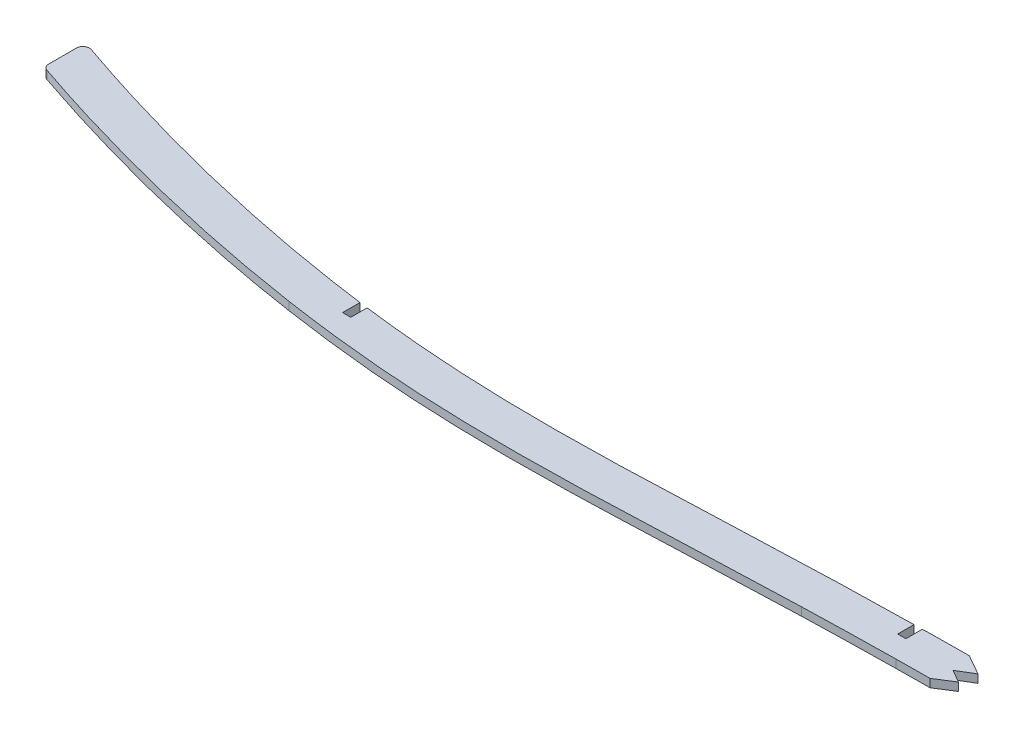
ISO-10303-21;
HEADER;
FILE_DESCRIPTION(('STEP AP214'),'2;1');
FILE_NAME('part.step','',(''),(''),'','','');
FILE_SCHEMA(('AUTOMOTIVE_DESIGN { 1 0 10303 214 1 1 1 1 }'));
ENDSEC;
DATA;
#1=APPLICATION_CONTEXT('core data for automotive mechanical design processes');
#2=APPLICATION_PROTOCOL_DEFINITION('international standard','automotive_design',2000,#1);
#3=PRODUCT_CONTEXT('',#1,'mechanical');
#4=PRODUCT('Part','Part','',(#3));
#5=PRODUCT_RELATED_PRODUCT_CATEGORY('part','',(#4));
#6=PRODUCT_DEFINITION_FORMATION('','',#4);
#7=PRODUCT_DEFINITION_CONTEXT('part definition',#1,'design');
#8=PRODUCT_DEFINITION('design','',#6,#7);
#9=PRODUCT_DEFINITION_SHAPE('','',#8);
#10=(LENGTH_UNIT() NAMED_UNIT(*) SI_UNIT(.MILLI.,.METRE.));
#11=(NAMED_UNIT(*) PLANE_ANGLE_UNIT() SI_UNIT($,.RADIAN.));
#12=(NAMED_UNIT(*) SI_UNIT($,.STERADIAN.) SOLID_ANGLE_UNIT());
#13=UNCERTAINTY_MEASURE_WITH_UNIT(LENGTH_MEASURE(1.E-05),#10,'distance_accuracy_value','');
#14=(GEOMETRIC_REPRESENTATION_CONTEXT(3) GLOBAL_UNCERTAINTY_ASSIGNED_CONTEXT((#13)) GLOBAL_UNIT_ASSIGNED_CONTEXT((#10,
#11,#12)) REPRESENTATION_CONTEXT('',''));
#15=CARTESIAN_POINT('',(0.,0.,0.));
#16=DIRECTION('',(0.,0.,1.));
#17=DIRECTION('',(1.,0.,0.));
#18=AXIS2_PLACEMENT_3D('',#15,#16,#17);
#19=CARTESIAN_POINT('',(427.350904326957,1.5875,99.7556868732447));
#20=CARTESIAN_POINT('',(418.862421221252,1.5875,100.00812461432));
#21=CARTESIAN_POINT('',(401.866088129028,1.5875,100.608803356656));
#22=CARTESIAN_POINT('',(368.059852938545,1.5875,102.023512544895));
#23=CARTESIAN_POINT('',(334.562278264585,1.5875,103.305731983871));
#24=CARTESIAN_POINT('',(301.483653152495,1.5875,103.218702015563));
#25=CARTESIAN_POINT('',(276.79777730725,1.5875,102.194932026638));
#26=CARTESIAN_POINT('',(252.276409009876,1.5875,100.070407206761));
#27=CARTESIAN_POINT('',(235.925248591308,1.5875,97.9234379605591));
#28=CARTESIAN_POINT('',(227.785190571596,1.5875,96.6922599410784));
#29=B_SPLINE_CURVE_WITH_KNOTS('',3,(#19,#20,#21,#22,#23,#24,#25,#26,#27,#28),.UNSPECIFIED.,.F.,
.F.,(4,1,1,1,1,1,1,4),(0.,0.125038463371066,0.250076926742131,0.500153853484262,
0.625192316855328,0.750230780226393,0.875269243597459,1.00030770696852),.UNSPECIFIED.);
#30=DIRECTION('',(0.,-1.,0.));
#31=VECTOR('',#30,1.);
#32=SURFACE_OF_LINEAR_EXTRUSION('',#29,#31);
#33=CARTESIAN_POINT('',(239.712500009746,1.5875,98.377714810833));
#34=VERTEX_POINT('',#33);
#35=CARTESIAN_POINT('',(227.785190571596,1.5875,96.6922599410784));
#36=VERTEX_POINT('',#35);
#37=EDGE_CURVE('E595',#34,#36,#29,.T.);
#38=ORIENTED_EDGE('',*,*,#37,.F.);
#39=DIRECTION('',(0.,1.,0.));
#40=VECTOR('',#39,1.);
#41=CARTESIAN_POINT('',(239.712500009746,-1.59253086897977,98.377714810833));
#42=LINE('',#41,#40);
#43=CARTESIAN_POINT('',(239.712501171631,-1.59000649895303,98.3777240074874));
#44=VERTEX_POINT('',#43);
#45=EDGE_CURVE('E514',#44,#34,#42,.T.);
#46=ORIENTED_EDGE('',*,*,#45,.F.);
#47=CARTESIAN_POINT('',(239.712504650265,-1.5875,98.3777154197211));
#48=CARTESIAN_POINT('',(235.731103081049,-1.5875,97.8553110047139));
#49=CARTESIAN_POINT('',(231.753924821069,-1.5875,97.2925281899385));
#50=CARTESIAN_POINT('',(227.785190571596,-1.5875,96.6922599410784));
#51=B_SPLINE_CURVE_WITH_KNOTS('',3,(#47,#48,#49,#50),.UNSPECIFIED.,.F.,.F.,(4,4),
(0.939344452053071,1.00030770696852),.UNSPECIFIED.);
#52=CARTESIAN_POINT('',(227.785190571596,-1.5875,96.6922599410784));
#53=VERTEX_POINT('',#52);
#54=EDGE_CURVE('E512',#44,#53,#51,.T.);
#55=ORIENTED_EDGE('',*,*,#54,.T.);
#56=DIRECTION('',(0.,-1.,0.));
#57=VECTOR('',#56,1.);
#58=CARTESIAN_POINT('',(227.785190571596,1.5875,96.6922599410784));
#59=LINE('',#58,#57);
#60=EDGE_CURVE('E379',#36,#53,#59,.T.);
#61=ORIENTED_EDGE('',*,*,#60,.F.);
#62=EDGE_LOOP('',(#38,#46,#55,#61));
#63=FACE_BOUND('',#62,.T.);
#64=ADVANCED_FACE('F40',(#63),#32,.F.);
#65=CARTESIAN_POINT('',(2.34506745307613,1.5875,108.907214272745));
#66=DIRECTION('',(0.0215277197524686,0.,0.999768251787512));
#67=DIRECTION('',(0.999768251787513,0.,-0.0215277197524686));
#68=AXIS2_PLACEMENT_3D('',#65,#66,#67);
#69=PLANE('',#68);
#70=DIRECTION('',(-0.999768251787513,0.,0.0215277197524686));
#71=VECTOR('',#70,1.);
#72=CARTESIAN_POINT('',(2.34506745307613,1.5875,108.907214272745));
#73=LINE('',#72,#71);
#74=CARTESIAN_POINT('',(455.6125,1.5875,99.1471381317549));
#75=VERTEX_POINT('',#74);
#76=CARTESIAN_POINT('',(427.350904326957,1.5875,99.7556868732447));
#77=VERTEX_POINT('',#76);
#78=EDGE_CURVE('E225',#75,#77,#73,.T.);
#79=ORIENTED_EDGE('',*,*,#78,.F.);
#80=DIRECTION('',(0.,1.,0.));
#81=VECTOR('',#80,1.);
#82=CARTESIAN_POINT('',(455.6125,-1.59253086897977,99.1471381317549));
#83=LINE('',#82,#81);
#84=CARTESIAN_POINT('',(455.6125,-1.5875,99.1471381317549));
#85=VERTEX_POINT('',#84);
#86=EDGE_CURVE('E535',#85,#75,#83,.T.);
#87=ORIENTED_EDGE('',*,*,#86,.F.);
#88=DIRECTION('',(-0.999768251787513,0.,0.0215277197524686));
#89=VECTOR('',#88,1.);
#90=CARTESIAN_POINT('',(2.34506745307613,-1.5875,108.907214272745));
#91=LINE('',#90,#89);
#92=CARTESIAN_POINT('',(427.350904326957,-1.5875,99.7556868732447));
#93=VERTEX_POINT('',#92);
#94=EDGE_CURVE('E634',#85,#93,#91,.T.);
#95=ORIENTED_EDGE('',*,*,#94,.T.);
#96=DIRECTION('',(0.,-1.,0.));
#97=VECTOR('',#96,1.);
#98=CARTESIAN_POINT('',(427.350904326957,1.5875,99.7556868732447));
#99=LINE('',#98,#97);
#100=EDGE_CURVE('E640',#77,#93,#99,.T.);
#101=ORIENTED_EDGE('',*,*,#100,.F.);
#102=EDGE_LOOP('',(#79,#87,#95,#101));
#103=FACE_BOUND('',#102,.T.);
#104=ADVANCED_FACE('F604',(#103),#69,.F.);
#105=CARTESIAN_POINT('',(427.350904326957,-1.5875,99.7556868732447));
#106=CARTESIAN_POINT('',(418.862421221252,-1.5875,100.00812461432));
#107=CARTESIAN_POINT('',(401.866088129028,-1.5875,100.608803356656));
#108=CARTESIAN_POINT('',(368.059852938545,-1.5875,102.023512544895));
#109=CARTESIAN_POINT('',(334.562278264585,-1.5875,103.305731983871));
#110=CARTESIAN_POINT('',(301.483653152495,-1.5875,103.218702015563));
#111=CARTESIAN_POINT('',(276.79777730725,-1.5875,102.194932026638));
#112=CARTESIAN_POINT('',(257.320654603802,-1.5875,100.507439301866));
#113=CARTESIAN_POINT('',(246.015609041535,-1.5875,99.1788225006703));
#114=CARTESIAN_POINT('',(242.887503878056,-1.5875,98.7855945199044));
#115=B_SPLINE_CURVE_WITH_KNOTS('',3,(#105,#106,#107,#108,#109,#110,#111,#112,#113,#114),
.UNSPECIFIED.,.F.,.F.,(4,1,1,1,1,1,1,4),(0.,0.125038463371066,0.250076926742131,
0.500153853484262,0.625192316855328,0.750230780226393,0.875269243597459,0.923143409656655),.UNSPECIFIED.);
#116=CARTESIAN_POINT('',(242.887500976793,-1.59000766215881,98.7856020129353));
#117=VERTEX_POINT('',#116);
#118=EDGE_CURVE('E508',#93,#117,#115,.T.);
#119=ORIENTED_EDGE('',*,*,#118,.T.);
#120=DIRECTION('',(0.,1.,0.));
#121=VECTOR('',#120,1.);
#122=CARTESIAN_POINT('',(242.887500008359,-1.59253086897977,98.7855940334524));
#123=LINE('',#122,#121);
#124=CARTESIAN_POINT('',(242.887500008359,1.5875,98.7855940334524));
#125=VERTEX_POINT('',#124);
#126=EDGE_CURVE('E516',#117,#125,#123,.T.);
#127=ORIENTED_EDGE('',*,*,#126,.T.);
#128=EDGE_CURVE('E589',#77,#125,#29,.T.);
#129=ORIENTED_EDGE('',*,*,#128,.F.);
#130=ORIENTED_EDGE('',*,*,#100,.T.);
#131=EDGE_LOOP('',(#119,#127,#129,#130));
#132=FACE_BOUND('',#131,.T.);
#133=ADVANCED_FACE('F600',(#132),#32,.F.);
#134=CARTESIAN_POINT('',(227.785191307895,1.5875,96.6922600524431));
#135=CARTESIAN_POINT('',(213.110880786697,1.5875,94.4727802291809));
#136=CARTESIAN_POINT('',(183.934692991096,1.5875,89.0066199754296));
#137=CARTESIAN_POINT('',(142.715027591918,1.5875,78.57172303812));
#138=CARTESIAN_POINT('',(112.830147637075,1.5875,69.1583242661681));
#139=CARTESIAN_POINT('',(91.7769943395039,1.5875,61.7380554247817));
#140=CARTESIAN_POINT('',(75.8295901605427,1.5875,55.7697356300159));
#141=CARTESIAN_POINT('',(63.4647107096766,1.5875,50.7781592149505));
#142=CARTESIAN_POINT('',(56.5889605199003,1.5875,47.8982346995993));
#143=B_SPLINE_CURVE_WITH_KNOTS('',3,(#134,#135,#136,#137,#138,#139,#140,#141,#142),
.UNSPECIFIED.,.F.,.F.,(4,1,1,1,1,1,4),(0.000149215878039843,0.25011191190853,0.50007460793902,
0.714106561415409,0.776597235423031,0.875018651984755,1.),.UNSPECIFIED.);
#144=DIRECTION('',(0.,-1.,0.));
#145=VECTOR('',#144,1.);
#146=SURFACE_OF_LINEAR_EXTRUSION('',#143,#145);
#147=CARTESIAN_POINT('',(227.785191307895,-1.5875,96.6922600524431));
#148=CARTESIAN_POINT('',(213.110880786697,-1.5875,94.4727802291809));
#149=CARTESIAN_POINT('',(183.934692991096,-1.5875,89.0066199754296));
#150=CARTESIAN_POINT('',(142.715027591918,-1.5875,78.57172303812));
#151=CARTESIAN_POINT('',(112.830147637075,-1.5875,69.1583242661681));
#152=CARTESIAN_POINT('',(91.7769943395039,-1.5875,61.7380554247817));
#153=CARTESIAN_POINT('',(75.8295901605427,-1.5875,55.7697356300159));
#154=CARTESIAN_POINT('',(63.4647107096766,-1.5875,50.7781592149505));
#155=CARTESIAN_POINT('',(56.5889605199003,-1.5875,47.8982346995993));
#156=B_SPLINE_CURVE_WITH_KNOTS('',3,(#147,#148,#149,#150,#151,#152,#153,#154,#155),
.UNSPECIFIED.,.F.,.F.,(4,1,1,1,1,1,4),(0.000149215878039843,0.25011191190853,0.50007460793902,
0.714106561415409,0.776597235423031,0.875018651984755,1.),.UNSPECIFIED.);
#157=CARTESIAN_POINT('',(102.432625698107,-1.5875,65.4769363256329));
#158=VERTEX_POINT('',#157);
#159=EDGE_CURVE('E374',#53,#158,#156,.T.);
#160=ORIENTED_EDGE('',*,*,#159,.T.);
#161=DIRECTION('',(0.,-1.,0.));
#162=VECTOR('',#161,1.);
#163=CARTESIAN_POINT('',(102.432625698107,-1.5875,65.4769363256329));
#164=LINE('',#163,#162);
#165=CARTESIAN_POINT('',(102.432625698107,1.5875,65.4769363256329));
#166=VERTEX_POINT('',#165);
#167=EDGE_CURVE('E730',#158,#166,#164,.F.);
#168=ORIENTED_EDGE('',*,*,#167,.T.);
#169=EDGE_CURVE('E325',#36,#166,#143,.T.);
#170=ORIENTED_EDGE('',*,*,#169,.F.);
#171=ORIENTED_EDGE('',*,*,#60,.T.);
#172=EDGE_LOOP('',(#160,#168,#170,#171));
#173=FACE_BOUND('',#172,.T.);
#174=ADVANCED_FACE('F603',(#173),#146,.F.);
#175=CARTESIAN_POINT('',(99.0600000000291,1.5875,3.58623917478634E-11));
#176=DIRECTION('',(1.,0.,3.62026971005985E-13));
#177=DIRECTION('',(3.62026971005985E-13,0.,-1.));
#178=AXIS2_PLACEMENT_3D('',#175,#176,#177);
#179=PLANE('',#178);
#180=DIRECTION('',(-3.62026971005985E-13,0.,1.));
#181=VECTOR('',#180,1.);
#182=CARTESIAN_POINT('',(99.0600000000291,1.5875,3.58623917478634E-11));
#183=LINE('',#182,#181);
#184=CARTESIAN_POINT('',(99.0600000000046,1.5875,67.8765893103071));
#185=VERTEX_POINT('',#184);
#186=CARTESIAN_POINT('',(99.0600000000007,1.5875,78.6220496211011));
#187=VERTEX_POINT('',#186);
#188=EDGE_CURVE('E385',#185,#187,#183,.T.);
#189=ORIENTED_EDGE('',*,*,#188,.F.);
#190=DIRECTION('',(0.,-1.,0.));
#191=VECTOR('',#190,1.);
#192=CARTESIAN_POINT('',(99.0600000000046,1.5875,67.8765893103071));
#193=LINE('',#192,#191);
#194=CARTESIAN_POINT('',(99.0600000000046,-1.5875,67.8765893103071));
#195=VERTEX_POINT('',#194);
#196=EDGE_CURVE('E732',#185,#195,#193,.T.);
#197=ORIENTED_EDGE('',*,*,#196,.T.);
#198=DIRECTION('',(-3.62026971005985E-13,0.,1.));
#199=VECTOR('',#198,1.);
#200=CARTESIAN_POINT('',(99.0600000000291,-1.5875,3.58623917478634E-11));
#201=LINE('',#200,#199);
#202=CARTESIAN_POINT('',(99.0600000000007,-1.5875,78.6220496211011));
#203=VERTEX_POINT('',#202);
#204=EDGE_CURVE('E370',#195,#203,#201,.T.);
#205=ORIENTED_EDGE('',*,*,#204,.T.);
#206=DIRECTION('',(0.,-1.,0.));
#207=VECTOR('',#206,1.);
#208=CARTESIAN_POINT('',(99.0600000000007,1.5875,78.6220496211011));
#209=LINE('',#208,#207);
#210=EDGE_CURVE('E734',#203,#187,#209,.F.);
#211=ORIENTED_EDGE('',*,*,#210,.T.);
#212=EDGE_LOOP('',(#189,#197,#205,#211));
#213=FACE_BOUND('',#212,.T.);
#214=ADVANCED_FACE('F337',(#213),#179,.F.);
#215=CARTESIAN_POINT('',(50.6761621364999,1.5875,61.9444848198859));
#216=CARTESIAN_POINT('',(57.6823781288773,1.5875,64.8793101667965));
#217=CARTESIAN_POINT('',(64.7243394536137,1.5875,67.7223408447282));
#218=CARTESIAN_POINT('',(78.8870729125248,1.5875,73.2060145967594));
#219=CARTESIAN_POINT('',(86.0092944490418,1.5875,75.8470754092059));
#220=CARTESIAN_POINT('',(100.330558421128,1.5875,80.912794884782));
#221=CARTESIAN_POINT('',(107.526909654812,1.5875,83.3366686707374));
#222=CARTESIAN_POINT('',(121.992341977537,1.5875,87.9625041634259));
#223=CARTESIAN_POINT('',(129.263501237114,1.5875,90.1652003972794));
#224=CARTESIAN_POINT('',(143.866524862885,1.5875,94.3443567097248));
#225=CARTESIAN_POINT('',(151.198099160498,1.5875,96.3209395741513));
#226=CARTESIAN_POINT('',(165.92167747037,1.5875,100.04696927944));
#227=CARTESIAN_POINT('',(173.315840114448,1.5875,101.797066047311));
#228=CARTESIAN_POINT('',(195.561746524815,1.5875,106.692610649793));
#229=CARTESIAN_POINT('',(210.483089349829,1.5875,109.488660695529));
#230=CARTESIAN_POINT('',(225.50607288422,1.5875,111.76087708291));
#231=B_SPLINE_CURVE_WITH_KNOTS('',3,(#215,#216,#217,#218,#219,#220,#221,#222,#223,#224,#225,
#226,#227,#228,#229,#230),.UNSPECIFIED.,.F.,.F.,(4,2,2,2,2,2,2,4),(0.,0.125,0.25,0.375,0.5,
0.625,0.75,1.),.UNSPECIFIED.);
#232=DIRECTION('',(0.,-1.,0.));
#233=VECTOR('',#232,1.);
#234=SURFACE_OF_LINEAR_EXTRUSION('',#231,#233);
#235=CARTESIAN_POINT('',(225.50607288422,1.5875,111.76087708291));
#236=CARTESIAN_POINT('',(210.483089349829,1.5875,109.488660695529));
#237=CARTESIAN_POINT('',(195.561746524815,1.5875,106.692610649793));
#238=CARTESIAN_POINT('',(173.315840114448,1.5875,101.797066047311));
#239=CARTESIAN_POINT('',(165.92167747037,1.5875,100.04696927944));
#240=CARTESIAN_POINT('',(151.198099160498,1.5875,96.3209395741513));
#241=CARTESIAN_POINT('',(143.866524862885,1.5875,94.3443567097248));
#242=CARTESIAN_POINT('',(129.263501237114,1.5875,90.1652003972794));
#243=CARTESIAN_POINT('',(121.992341977537,1.5875,87.9625041634259));
#244=CARTESIAN_POINT('',(110.084171304577,1.5875,84.1544438633247));
#245=CARTESIAN_POINT('',(105.423912732486,1.5875,82.6129357212513));
#246=CARTESIAN_POINT('',(100.778675684595,1.5875,81.0255941638394));
#247=B_SPLINE_CURVE_WITH_KNOTS('',3,(#235,#236,#237,#238,#239,#240,#241,#242,#243,#244,#245,
#246),.UNSPECIFIED.,.F.,.F.,(4,2,2,2,2,4),(0.294196080571812,0.544196080571812,
0.669196080571812,0.794196080571812,0.919196080571812,1.),.UNSPECIFIED.);
#248=CARTESIAN_POINT('',(100.778676956211,1.5875,81.0255904425485));
#249=VERTEX_POINT('',#248);
#250=CARTESIAN_POINT('',(225.50607288422,1.5875,111.76087708291));
#251=VERTEX_POINT('',#250);
#252=EDGE_CURVE('E389',#249,#251,#247,.F.);
#253=ORIENTED_EDGE('',*,*,#252,.F.);
#254=DIRECTION('',(0.,-1.,0.));
#255=VECTOR('',#254,1.);
#256=CARTESIAN_POINT('',(100.778675684688,1.5875,81.0255941638712));
#257=LINE('',#256,#255);
#258=CARTESIAN_POINT('',(100.778676944463,-1.5875,81.025590476933));
#259=VERTEX_POINT('',#258);
#260=EDGE_CURVE('E746',#249,#259,#257,.T.);
#261=ORIENTED_EDGE('',*,*,#260,.T.);
#262=CARTESIAN_POINT('',(100.778675684627,-1.5875,81.0255941638504));
#263=CARTESIAN_POINT('',(105.423912732508,-1.5875,82.6129357212584));
#264=CARTESIAN_POINT('',(110.084171304588,-1.5875,84.1544438633281));
#265=CARTESIAN_POINT('',(121.992341977537,-1.5875,87.9625041634259));
#266=CARTESIAN_POINT('',(129.263501237114,-1.5875,90.1652003972794));
#267=CARTESIAN_POINT('',(143.866524862885,-1.5875,94.3443567097248));
#268=CARTESIAN_POINT('',(151.198099160498,-1.5875,96.3209395741513));
#269=CARTESIAN_POINT('',(165.92167747037,-1.5875,100.04696927944));
#270=CARTESIAN_POINT('',(173.315840114448,-1.5875,101.797066047311));
#271=CARTESIAN_POINT('',(195.561746524815,-1.5875,106.692610649793));
#272=CARTESIAN_POINT('',(210.483089349829,-1.5875,109.488660695529));
#273=CARTESIAN_POINT('',(225.50607288422,-1.5875,111.76087708291));
#274=B_SPLINE_CURVE_WITH_KNOTS('',3,(#262,#263,#264,#265,#266,#267,#268,#269,#270,#271,#272,
#273),.UNSPECIFIED.,.F.,.F.,(4,2,2,2,2,4),(0.294196080571998,0.375,0.5,0.625,0.75,1.),.UNSPECIFIED.);
#275=CARTESIAN_POINT('',(225.50607288422,-1.5875,111.76087708291));
#276=VERTEX_POINT('',#275);
#277=EDGE_CURVE('E364',#259,#276,#274,.T.);
#278=ORIENTED_EDGE('',*,*,#277,.T.);
#279=DIRECTION('',(0.,-1.,0.));
#280=VECTOR('',#279,1.);
#281=CARTESIAN_POINT('',(225.50607288422,1.5875,111.76087708291));
#282=LINE('',#281,#280);
#283=EDGE_CURVE('E443',#251,#276,#282,.T.);
#284=ORIENTED_EDGE('',*,*,#283,.F.);
#285=EDGE_LOOP('',(#253,#261,#278,#284));
#286=FACE_BOUND('',#285,.T.);
#287=ADVANCED_FACE('F333',(#286),#234,.F.);
#288=CARTESIAN_POINT('',(225.50607288422,1.5875,111.76087708291));
#289=CARTESIAN_POINT('',(233.858386735715,1.5875,113.024158646857));
#290=CARTESIAN_POINT('',(242.227594966876,1.5875,114.122194791434));
#291=CARTESIAN_POINT('',(259.003461576626,1.5875,115.951963881505));
#292=CARTESIAN_POINT('',(267.410478960972,1.5875,116.680185359989));
#293=CARTESIAN_POINT('',(280.049991071998,1.5875,117.48900261458));
#294=CARTESIAN_POINT('',(284.269179279777,1.5875,117.711854610577));
#295=CARTESIAN_POINT('',(292.706766587907,1.5875,118.068182791326));
#296=CARTESIAN_POINT('',(296.925968195673,1.5875,118.201752470167));
#297=CARTESIAN_POINT('',(309.5846864989,1.5875,118.480744306246));
#298=CARTESIAN_POINT('',(318.025325164944,1.5875,118.503521129368));
#299=CARTESIAN_POINT('',(334.908743784948,1.5875,118.315005383669));
#300=CARTESIAN_POINT('',(343.352388311788,1.5875,118.104618682601));
#301=CARTESIAN_POINT('',(360.233144501551,1.5875,117.562255384496));
#302=CARTESIAN_POINT('',(368.671341038302,1.5875,117.230934370706));
#303=CARTESIAN_POINT('',(385.546900881357,1.5875,116.545322544921));
#304=CARTESIAN_POINT('',(393.984302215397,1.5875,116.192080049761));
#305=CARTESIAN_POINT('',(410.861092672443,1.5875,115.540392758357));
#306=CARTESIAN_POINT('',(419.300477695969,1.5875,115.241834951093));
#307=CARTESIAN_POINT('',(427.741586832949,1.5875,114.990806057452));
#308=B_SPLINE_CURVE_WITH_KNOTS('',3,(#288,#289,#290,#291,#292,#293,#294,#295,#296,#297,#298,
#299,#300,#301,#302,#303,#304,#305,#306,#307),.UNSPECIFIED.,.F.,.F.,(4,2,2,2,2,2,2,2,2,4),(0.,
0.125,0.249999999999999,0.312499999999999,0.374999999999999,0.499999999999999,0.624999999999999,
0.749999999999999,0.875,1.),.UNSPECIFIED.);
#309=DIRECTION('',(0.,-1.,0.));
#310=VECTOR('',#309,1.);
#311=SURFACE_OF_LINEAR_EXTRUSION('',#308,#310);
#312=CARTESIAN_POINT('',(225.50607288422,-1.5875,111.76087708291));
#313=CARTESIAN_POINT('',(233.858386735715,-1.5875,113.024158646857));
#314=CARTESIAN_POINT('',(242.227594966876,-1.5875,114.122194791434));
#315=CARTESIAN_POINT('',(259.003461576626,-1.5875,115.951963881505));
#316=CARTESIAN_POINT('',(267.410478960972,-1.5875,116.680185359989));
#317=CARTESIAN_POINT('',(280.049991071998,-1.5875,117.48900261458));
#318=CARTESIAN_POINT('',(284.269179279777,-1.5875,117.711854610577));
#319=CARTESIAN_POINT('',(292.706766587907,-1.5875,118.068182791326));
#320=CARTESIAN_POINT('',(296.925968195673,-1.5875,118.201752470167));
#321=CARTESIAN_POINT('',(309.5846864989,-1.5875,118.480744306246));
#322=CARTESIAN_POINT('',(318.025325164944,-1.5875,118.503521129368));
#323=CARTESIAN_POINT('',(334.908743784948,-1.5875,118.315005383669));
#324=CARTESIAN_POINT('',(343.352388311788,-1.5875,118.104618682601));
#325=CARTESIAN_POINT('',(360.233144501551,-1.5875,117.562255384496));
#326=CARTESIAN_POINT('',(368.671341038302,-1.5875,117.230934370706));
#327=CARTESIAN_POINT('',(385.546900881357,-1.5875,116.545322544921));
#328=CARTESIAN_POINT('',(393.984302215397,-1.5875,116.192080049761));
#329=CARTESIAN_POINT('',(410.861092672443,-1.5875,115.540392758357));
#330=CARTESIAN_POINT('',(419.300477695969,-1.5875,115.241834951093));
#331=CARTESIAN_POINT('',(427.741586832949,-1.5875,114.990806057452));
#332=B_SPLINE_CURVE_WITH_KNOTS('',3,(#312,#313,#314,#315,#316,#317,#318,#319,#320,#321,#322,
#323,#324,#325,#326,#327,#328,#329,#330,#331),.UNSPECIFIED.,.F.,.F.,(4,2,2,2,2,2,2,2,2,4),(0.,
0.125,0.249999999999999,0.312499999999999,0.374999999999999,0.499999999999999,0.624999999999999,
0.749999999999999,0.875,1.),.UNSPECIFIED.);
#333=CARTESIAN_POINT('',(427.741586832949,-1.5875,114.990806057452));
#334=VERTEX_POINT('',#333);
#335=EDGE_CURVE('E492',#276,#334,#332,.T.);
#336=ORIENTED_EDGE('',*,*,#335,.T.);
#337=DIRECTION('',(0.,-1.,0.));
#338=VECTOR('',#337,1.);
#339=CARTESIAN_POINT('',(427.741586832949,1.5875,114.990806057452));
#340=LINE('',#339,#338);
#341=CARTESIAN_POINT('',(427.741586832949,1.5875,114.990806057452));
#342=VERTEX_POINT('',#341);
#343=EDGE_CURVE('E435',#342,#334,#340,.T.);
#344=ORIENTED_EDGE('',*,*,#343,.F.);
#345=CARTESIAN_POINT('',(427.741586832949,1.5875,114.990806057452));
#346=CARTESIAN_POINT('',(419.300477695969,1.5875,115.241834951093));
#347=CARTESIAN_POINT('',(410.861092672443,1.5875,115.540392758357));
#348=CARTESIAN_POINT('',(393.984302215397,1.5875,116.192080049761));
#349=CARTESIAN_POINT('',(385.546900881357,1.5875,116.545322544921));
#350=CARTESIAN_POINT('',(368.671341038302,1.5875,117.230934370706));
#351=CARTESIAN_POINT('',(360.233144501551,1.5875,117.562255384496));
#352=CARTESIAN_POINT('',(343.352388311788,1.5875,118.104618682601));
#353=CARTESIAN_POINT('',(334.908743784948,1.5875,118.315005383669));
#354=CARTESIAN_POINT('',(318.025325164944,1.5875,118.503521129368));
#355=CARTESIAN_POINT('',(309.5846864989,1.5875,118.480744306246));
#356=CARTESIAN_POINT('',(296.925968195673,1.5875,118.201752470167));
#357=CARTESIAN_POINT('',(292.706766587907,1.5875,118.068182791326));
#358=CARTESIAN_POINT('',(284.269179279777,1.5875,117.711854610577));
#359=CARTESIAN_POINT('',(280.049991071998,1.5875,117.48900261458));
#360=CARTESIAN_POINT('',(267.410478960972,1.5875,116.680185359989));
#361=CARTESIAN_POINT('',(259.003461576626,1.5875,115.951963881505));
#362=CARTESIAN_POINT('',(242.227594966876,1.5875,114.122194791434));
#363=CARTESIAN_POINT('',(233.858386735715,1.5875,113.024158646857));
#364=CARTESIAN_POINT('',(225.50607288422,1.5875,111.76087708291));
#365=B_SPLINE_CURVE_WITH_KNOTS('',3,(#345,#346,#347,#348,#349,#350,#351,#352,#353,#354,#355,
#356,#357,#358,#359,#360,#361,#362,#363,#364),.UNSPECIFIED.,.F.,.F.,(4,2,2,2,2,2,2,2,2,4),(0.,
0.125,0.250000000000001,0.375000000000001,0.500000000000001,0.625000000000001,0.687500000000001,
0.750000000000001,0.875,1.),.UNSPECIFIED.);
#366=EDGE_CURVE('E467',#251,#342,#365,.F.);
#367=ORIENTED_EDGE('',*,*,#366,.F.);
#368=ORIENTED_EDGE('',*,*,#283,.T.);
#369=EDGE_LOOP('',(#336,#344,#367,#368));
#370=FACE_BOUND('',#369,.T.);
#371=ADVANCED_FACE('F302',(#370),#311,.F.);
#372=CARTESIAN_POINT('',(427.741586832949,1.5875,114.990806057452));
#373=CARTESIAN_POINT('',(433.729413487176,1.5875,114.812652176543));
#374=CARTESIAN_POINT('',(439.717847222605,1.5875,114.655194796858));
#375=CARTESIAN_POINT('',(451.695979442613,1.5875,114.395368300248));
#376=CARTESIAN_POINT('',(457.685533450018,1.5875,114.292726520533));
#377=CARTESIAN_POINT('',(463.675525417421,1.5875,114.216461910814));
#378=B_SPLINE_CURVE_WITH_KNOTS('',3,(#372,#373,#374,#375,#376,#377),.UNSPECIFIED.,.F.,.F.,(4,2,
4),(0.,0.5,1.),.UNSPECIFIED.);
#379=DIRECTION('',(0.,-1.,0.));
#380=VECTOR('',#379,1.);
#381=SURFACE_OF_LINEAR_EXTRUSION('',#378,#380);
#382=CARTESIAN_POINT('',(427.741586832949,-1.5875,114.990806057452));
#383=CARTESIAN_POINT('',(433.729413487176,-1.5875,114.812652176543));
#384=CARTESIAN_POINT('',(439.717847222605,-1.5875,114.655194796858));
#385=CARTESIAN_POINT('',(451.695979442613,-1.5875,114.395368300248));
#386=CARTESIAN_POINT('',(457.685533450018,-1.5875,114.292726520533));
#387=CARTESIAN_POINT('',(463.675525417421,-1.5875,114.216461910814));
#388=B_SPLINE_CURVE_WITH_KNOTS('',3,(#382,#383,#384,#385,#386,#387),.UNSPECIFIED.,.F.,.F.,(4,2,
4),(0.,0.5,1.),.UNSPECIFIED.);
#389=CARTESIAN_POINT('',(463.675531571037,-1.5875,114.216461844629));
#390=VERTEX_POINT('',#389);
#391=EDGE_CURVE('E448',#334,#390,#388,.T.);
#392=ORIENTED_EDGE('',*,*,#391,.T.);
#393=CARTESIAN_POINT('',(463.675537724596,1.5875,114.216461773581));
#394=DIRECTION('',(0.,-1.,0.));
#395=VECTOR('',#394,1.);
#396=LINE('',#393,#395);
#397=CARTESIAN_POINT('',(463.675531571037,1.5875,114.216461844629));
#398=VERTEX_POINT('',#397);
#399=EDGE_CURVE('E276',#398,#390,#396,.T.);
#400=ORIENTED_EDGE('',*,*,#399,.F.);
#401=CARTESIAN_POINT('',(463.675525417421,1.5875,114.216461910814));
#402=CARTESIAN_POINT('',(457.685533450018,1.5875,114.292726520533));
#403=CARTESIAN_POINT('',(451.695979442613,1.5875,114.395368300248));
#404=CARTESIAN_POINT('',(439.717847222605,1.5875,114.655194796858));
#405=CARTESIAN_POINT('',(433.729413487176,1.5875,114.812652176543));
#406=CARTESIAN_POINT('',(427.741586832949,1.5875,114.990806057452));
#407=B_SPLINE_CURVE_WITH_KNOTS('',3,(#401,#402,#403,#404,#405,#406),.UNSPECIFIED.,.F.,.F.,(4,2,
4),(0.,0.5,1.),.UNSPECIFIED.);
#408=EDGE_CURVE('E233',#342,#398,#407,.F.);
#409=ORIENTED_EDGE('',*,*,#408,.F.);
#410=ORIENTED_EDGE('',*,*,#343,.T.);
#411=EDGE_LOOP('',(#392,#400,#409,#410));
#412=FACE_BOUND('',#411,.T.);
#413=ADVANCED_FACE('F293',(#412),#381,.F.);
#414=CARTESIAN_POINT('',(463.675537724596,1.5875,114.216461773581));
#415=CARTESIAN_POINT('',(470.785382475025,1.5875,114.125939241133));
#416=CARTESIAN_POINT('',(477.895647472131,1.5875,114.072781143216));
#417=CARTESIAN_POINT('',(492.116266715422,1.5875,114.019175519368));
#418=CARTESIAN_POINT('',(499.226625181021,1.5875,114.017353529523));
#419=CARTESIAN_POINT('',(520.557752109465,1.5875,114.038242979904));
#420=CARTESIAN_POINT('',(534.778415195442,1.5875,114.088228036349));
#421=CARTESIAN_POINT('',(548.999079931237,1.5875,114.13626974423));
#422=B_SPLINE_CURVE_WITH_KNOTS('',3,(#414,#415,#416,#417,#418,#419,#420,#421),.UNSPECIFIED.,.F.,
.F.,(4,2,2,4),(0.,0.25,0.5,1.),.UNSPECIFIED.);
#423=DIRECTION('',(0.,-1.,0.));
#424=VECTOR('',#423,1.);
#425=SURFACE_OF_LINEAR_EXTRUSION('',#422,#424);
#426=CARTESIAN_POINT('',(463.675537724596,-1.5875,114.216461773581));
#427=CARTESIAN_POINT('',(468.049219358881,-1.5875,114.160776065727));
#428=CARTESIAN_POINT('',(472.423060022919,-1.5875,114.119229807755));
#429=CARTESIAN_POINT('',(476.796972276273,-1.5875,114.089260198695));
#430=B_SPLINE_CURVE_WITH_KNOTS('',3,(#426,#427,#428,#429),.UNSPECIFIED.,.F.,.F.,(4,4),(0.,
0.153789632116112),.UNSPECIFIED.);
#431=CARTESIAN_POINT('',(476.797007157656,-1.5875,114.089281569274));
#432=VERTEX_POINT('',#431);
#433=EDGE_CURVE('E504',#390,#432,#430,.T.);
#434=ORIENTED_EDGE('',*,*,#433,.T.);
#435=DIRECTION('',(0.,1.,0.));
#436=VECTOR('',#435,1.);
#437=CARTESIAN_POINT('',(476.79704174266,-6.0325,114.089259738876));
#438=LINE('',#437,#436);
#439=CARTESIAN_POINT('',(476.79697154391,1.5875,114.089304049026));
#440=VERTEX_POINT('',#439);
#441=EDGE_CURVE('E559',#432,#440,#438,.T.);
#442=ORIENTED_EDGE('',*,*,#441,.T.);
#443=CARTESIAN_POINT('',(476.7969712435,1.5875,114.089260205771));
#444=CARTESIAN_POINT('',(472.423059334415,1.5875,114.119229814295));
#445=CARTESIAN_POINT('',(468.049219014641,1.5875,114.16077607011));
#446=CARTESIAN_POINT('',(463.675537724596,1.5875,114.216461773581));
#447=B_SPLINE_CURVE_WITH_KNOTS('',3,(#443,#444,#445,#446),.UNSPECIFIED.,.F.,.F.,(4,4),(0.,
0.153789620011793),.UNSPECIFIED.);
#448=EDGE_CURVE('E226',#398,#440,#447,.F.);
#449=ORIENTED_EDGE('',*,*,#448,.F.);
#450=ORIENTED_EDGE('',*,*,#399,.T.);
#451=EDGE_LOOP('',(#434,#442,#449,#450));
#452=FACE_BOUND('',#451,.T.);
#453=ADVANCED_FACE('F255',(#452),#425,.F.);
#454=CARTESIAN_POINT('',(463.481517793035,1.5875,98.977696854266));
#455=CARTESIAN_POINT('',(470.636830326676,1.5875,98.8865954260712));
#456=CARTESIAN_POINT('',(484.96517985863,1.5875,98.7802909739378));
#457=CARTESIAN_POINT('',(506.357680508781,1.5875,98.7756080986052));
#458=CARTESIAN_POINT('',(527.715649674398,1.5875,98.8232205557799));
#459=CARTESIAN_POINT('',(541.937533287806,1.5875,98.8723267369625));
#460=CARTESIAN_POINT('',(549.050564968239,1.5875,98.8963567099974));
#461=B_SPLINE_CURVE_WITH_KNOTS('',3,(#454,#455,#456,#457,#458,#459,#460),.UNSPECIFIED.,.F.,.F.,
(4,1,1,1,4),(0.,0.25,0.5,0.75,1.),.UNSPECIFIED.);
#462=DIRECTION('',(0.,-1.,0.));
#463=VECTOR('',#462,1.);
#464=SURFACE_OF_LINEAR_EXTRUSION('',#461,#463);
#465=DIRECTION('',(0.,1.,0.));
#466=VECTOR('',#465,1.);
#467=CARTESIAN_POINT('',(476.79704174266,-6.0325,98.8490976113296));
#468=LINE('',#467,#466);
#469=CARTESIAN_POINT('',(476.79704174266,-1.5875,98.8490976113296));
#470=VERTEX_POINT('',#469);
#471=CARTESIAN_POINT('',(476.79704174266,1.5875,98.8490976113296));
#472=VERTEX_POINT('',#471);
#473=EDGE_CURVE('E195',#470,#472,#468,.T.);
#474=ORIENTED_EDGE('',*,*,#473,.F.);
#475=CARTESIAN_POINT('',(463.481517793035,-1.5875,98.977696854266));
#476=CARTESIAN_POINT('',(470.636830326676,-1.5875,98.8865954260712));
#477=CARTESIAN_POINT('',(484.96517985863,-1.5875,98.7802909739378));
#478=CARTESIAN_POINT('',(506.357680508781,-1.5875,98.7756080986052));
#479=CARTESIAN_POINT('',(527.715649674398,-1.5875,98.8232205557799));
#480=CARTESIAN_POINT('',(541.937533287806,-1.5875,98.8723267369625));
#481=CARTESIAN_POINT('',(549.050564968239,-1.5875,98.8963567099974));
#482=B_SPLINE_CURVE_WITH_KNOTS('',3,(#475,#476,#477,#478,#479,#480,#481),.UNSPECIFIED.,.F.,.F.,
(4,1,1,1,4),(0.,0.25,0.5,0.75,1.),.UNSPECIFIED.);
#483=CARTESIAN_POINT('',(463.481517793035,-1.5875,98.9776968542661));
#484=VERTEX_POINT('',#483);
#485=EDGE_CURVE('E629',#484,#470,#482,.T.);
#486=ORIENTED_EDGE('',*,*,#485,.F.);
#487=CARTESIAN_POINT('',(463.481517793035,-1.5875,98.977696854266));
#488=DIRECTION('',(0.,1.,0.));
#489=VECTOR('',#488,1.);
#490=LINE('',#487,#489);
#491=CARTESIAN_POINT('',(463.481517793035,1.5875,98.9776968542661));
#492=VERTEX_POINT('',#491);
#493=EDGE_CURVE('E221',#492,#484,#490,.F.);
#494=ORIENTED_EDGE('',*,*,#493,.F.);
#495=EDGE_CURVE('E214',#492,#472,#461,.T.);
#496=ORIENTED_EDGE('',*,*,#495,.T.);
#497=EDGE_LOOP('',(#474,#486,#494,#496));
#498=FACE_BOUND('',#497,.T.);
#499=ADVANCED_FACE('F220',(#498),#464,.T.);
#500=CARTESIAN_POINT('',(458.7875,-1.5875,99.0787717777605));
#501=VERTEX_POINT('',#500);
#502=EDGE_CURVE('E669',#484,#501,#91,.T.);
#503=ORIENTED_EDGE('',*,*,#502,.T.);
#504=DIRECTION('',(0.,1.,0.));
#505=VECTOR('',#504,1.);
#506=CARTESIAN_POINT('',(458.7875,-1.59253086897977,99.0787717777605));
#507=LINE('',#506,#505);
#508=CARTESIAN_POINT('',(458.7875,1.5875,99.0787717777605));
#509=VERTEX_POINT('',#508);
#510=EDGE_CURVE('E538',#501,#509,#507,.T.);
#511=ORIENTED_EDGE('',*,*,#510,.T.);
#512=EDGE_CURVE('E230',#492,#509,#73,.T.);
#513=ORIENTED_EDGE('',*,*,#512,.F.);
#514=ORIENTED_EDGE('',*,*,#493,.T.);
#515=EDGE_LOOP('',(#503,#511,#513,#514));
#516=FACE_BOUND('',#515,.T.);
#517=ADVANCED_FACE('F254',(#516),#69,.F.);
#518=CARTESIAN_POINT('',(0.,1.5875,0.));
#519=DIRECTION('',(0.,1.,0.));
#520=DIRECTION('',(0.,0.,1.));
#521=AXIS2_PLACEMENT_3D('',#518,#519,#520);
#522=PLANE('',#521);
#523=DIRECTION('',(-0.845628975685396,0.,0.533771145231051));
#524=VECTOR('',#523,1.);
#525=CARTESIAN_POINT('',(483.58113460883,1.5875,109.807059007054));
#526=LINE('',#525,#524);
#527=CARTESIAN_POINT('',(483.58113460883,1.5875,109.807059007054));
#528=VERTEX_POINT('',#527);
#529=EDGE_CURVE('E207',#528,#440,#526,.T.);
#530=ORIENTED_EDGE('',*,*,#529,.F.);
#531=DIRECTION('',(0.869563376637212,0.,0.49382135839926));
#532=VECTOR('',#531,1.);
#533=CARTESIAN_POINT('',(478.528826473051,1.5875,106.937874616711));
#534=LINE('',#533,#532);
#535=CARTESIAN_POINT('',(478.528826473051,1.5875,106.937874616711));
#536=VERTEX_POINT('',#535);
#537=EDGE_CURVE('E573',#536,#528,#534,.T.);
#538=ORIENTED_EDGE('',*,*,#537,.F.);
#539=DIRECTION('',(-0.858817935730487,0.,0.512280931977392));
#540=VECTOR('',#539,1.);
#541=CARTESIAN_POINT('',(484.630988808675,1.5875,103.297962968019));
#542=LINE('',#541,#540);
#543=CARTESIAN_POINT('',(484.630988808675,1.5875,103.297962968019));
#544=VERTEX_POINT('',#543);
#545=EDGE_CURVE('E217',#544,#536,#542,.T.);
#546=ORIENTED_EDGE('',*,*,#545,.F.);
#547=DIRECTION('',(0.869563376637202,0.,0.493821358399277));
#548=VECTOR('',#547,1.);
#549=CARTESIAN_POINT('',(476.79704174266,1.5875,98.8490976113296));
#550=LINE('',#549,#548);
#551=EDGE_CURVE('E198',#472,#544,#550,.T.);
#552=ORIENTED_EDGE('',*,*,#551,.F.);
#553=ORIENTED_EDGE('',*,*,#495,.F.);
#554=ORIENTED_EDGE('',*,*,#512,.T.);
#555=DIRECTION('',(0.,0.,-1.));
#556=VECTOR('',#555,1.);
#557=CARTESIAN_POINT('',(458.7875,1.5875,0.));
#558=LINE('',#557,#556);
#559=CARTESIAN_POINT('',(458.7875,1.5875,105.462954954758));
#560=VERTEX_POINT('',#559);
#561=EDGE_CURVE('E548',#560,#509,#558,.T.);
#562=ORIENTED_EDGE('',*,*,#561,.F.);
#563=DIRECTION('',(1.,0.,0.));
#564=VECTOR('',#563,1.);
#565=CARTESIAN_POINT('',(0.,1.5875,105.462954954758));
#566=LINE('',#565,#564);
#567=CARTESIAN_POINT('',(455.6125,1.5875,105.462954954758));
#568=VERTEX_POINT('',#567);
#569=EDGE_CURVE('E551',#568,#560,#566,.T.);
#570=ORIENTED_EDGE('',*,*,#569,.F.);
#571=DIRECTION('',(0.,0.,1.));
#572=VECTOR('',#571,1.);
#573=CARTESIAN_POINT('',(455.6125,1.5875,0.));
#574=LINE('',#573,#572);
#575=EDGE_CURVE('E555',#75,#568,#574,.T.);
#576=ORIENTED_EDGE('',*,*,#575,.F.);
#577=ORIENTED_EDGE('',*,*,#78,.T.);
#578=ORIENTED_EDGE('',*,*,#128,.T.);
#579=DIRECTION('',(0.,0.,-1.));
#580=VECTOR('',#579,1.);
#581=CARTESIAN_POINT('',(242.8875,1.5875,0.));
#582=LINE('',#581,#580);
#583=CARTESIAN_POINT('',(242.8875,1.5875,105.135594032402));
#584=VERTEX_POINT('',#583);
#585=EDGE_CURVE('E525',#584,#125,#582,.T.);
#586=ORIENTED_EDGE('',*,*,#585,.F.);
#587=DIRECTION('',(1.,0.,0.));
#588=VECTOR('',#587,1.);
#589=CARTESIAN_POINT('',(0.,1.5875,105.135594032402));
#590=LINE('',#589,#588);
#591=CARTESIAN_POINT('',(239.7125,1.5875,105.135594032402));
#592=VERTEX_POINT('',#591);
#593=EDGE_CURVE('E528',#592,#584,#590,.T.);
#594=ORIENTED_EDGE('',*,*,#593,.F.);
#595=DIRECTION('',(0.,0.,1.));
#596=VECTOR('',#595,1.);
#597=CARTESIAN_POINT('',(239.7125,1.5875,0.));
#598=LINE('',#597,#596);
#599=EDGE_CURVE('E531',#34,#592,#598,.T.);
#600=ORIENTED_EDGE('',*,*,#599,.F.);
#601=ORIENTED_EDGE('',*,*,#37,.T.);
#602=ORIENTED_EDGE('',*,*,#169,.T.);
#603=CARTESIAN_POINT('',(101.600000000005,1.5875,67.876589310308));
#604=DIRECTION('',(0.,1.,0.));
#605=DIRECTION('',(0.,0.,1.));
#606=AXIS2_PLACEMENT_3D('',#603,#604,#605);
#607=CIRCLE('',#606,2.54);
#608=EDGE_CURVE('E726',#166,#185,#607,.T.);
#609=ORIENTED_EDGE('',*,*,#608,.T.);
#610=ORIENTED_EDGE('',*,*,#188,.T.);
#611=CARTESIAN_POINT('',(101.600000000001,1.5875,78.622049621102));
#612=DIRECTION('',(0.,1.,0.));
#613=DIRECTION('',(0.,0.,1.));
#614=AXIS2_PLACEMENT_3D('',#611,#612,#613);
#615=CIRCLE('',#614,2.54);
#616=EDGE_CURVE('E384',#187,#249,#615,.T.);
#617=ORIENTED_EDGE('',*,*,#616,.T.);
#618=ORIENTED_EDGE('',*,*,#252,.T.);
#619=ORIENTED_EDGE('',*,*,#366,.T.);
#620=ORIENTED_EDGE('',*,*,#408,.T.);
#621=ORIENTED_EDGE('',*,*,#448,.T.);
#622=EDGE_LOOP('',(#530,#538,#546,#552,#553,#554,#562,#570,#576,#577,#578,#586,#594,#600,#601,
#602,#609,#610,#617,#618,#619,#620,#621));
#623=FACE_BOUND('',#622,.T.);
#624=ADVANCED_FACE('F212',(#623),#522,.T.);
#625=CARTESIAN_POINT('',(0.,-1.5875,0.));
#626=DIRECTION('',(0.,1.,0.));
#627=DIRECTION('',(0.,0.,1.));
#628=AXIS2_PLACEMENT_3D('',#625,#626,#627);
#629=PLANE('',#628);
#630=DIRECTION('',(0.869563376637212,0.,0.49382135839926));
#631=VECTOR('',#630,1.);
#632=CARTESIAN_POINT('',(70.7737342698243,-1.5875,-124.624515125034));
#633=LINE('',#632,#631);
#634=CARTESIAN_POINT('',(478.528826473051,-1.5875,106.937874616711));
#635=VERTEX_POINT('',#634);
#636=CARTESIAN_POINT('',(483.58113460883,-1.5875,109.807059007054));
#637=VERTEX_POINT('',#636);
#638=EDGE_CURVE('E50',#635,#637,#633,.T.);
#639=ORIENTED_EDGE('',*,*,#638,.T.);
#640=DIRECTION('',(-0.845628975685396,0.,0.533771145231051));
#641=VECTOR('',#640,1.);
#642=CARTESIAN_POINT('',(187.341761867647,-1.5875,296.796901830767));
#643=LINE('',#642,#641);
#644=EDGE_CURVE('E11',#637,#432,#643,.T.);
#645=ORIENTED_EDGE('',*,*,#644,.T.);
#646=ORIENTED_EDGE('',*,*,#433,.F.);
#647=ORIENTED_EDGE('',*,*,#391,.F.);
#648=ORIENTED_EDGE('',*,*,#335,.F.);
#649=ORIENTED_EDGE('',*,*,#277,.F.);
#650=CARTESIAN_POINT('',(101.600000000001,-1.5875,78.622049621102));
#651=DIRECTION('',(0.,1.,0.));
#652=DIRECTION('',(0.,0.,1.));
#653=AXIS2_PLACEMENT_3D('',#650,#651,#652);
#654=CIRCLE('',#653,2.54);
#655=EDGE_CURVE('E375',#259,#203,#654,.F.);
#656=ORIENTED_EDGE('',*,*,#655,.T.);
#657=ORIENTED_EDGE('',*,*,#204,.F.);
#658=CARTESIAN_POINT('',(101.600000000005,-1.5875,67.876589310308));
#659=DIRECTION('',(0.,1.,0.));
#660=DIRECTION('',(0.,0.,1.));
#661=AXIS2_PLACEMENT_3D('',#658,#659,#660);
#662=CIRCLE('',#661,2.54);
#663=EDGE_CURVE('E378',#195,#158,#662,.F.);
#664=ORIENTED_EDGE('',*,*,#663,.T.);
#665=ORIENTED_EDGE('',*,*,#159,.F.);
#666=ORIENTED_EDGE('',*,*,#54,.F.);
#667=DIRECTION('',(0.,0.,1.));
#668=VECTOR('',#667,1.);
#669=CARTESIAN_POINT('',(239.7125,-1.5875,0.));
#670=LINE('',#669,#668);
#671=CARTESIAN_POINT('',(239.7125,-1.5875,105.135594032402));
#672=VERTEX_POINT('',#671);
#673=EDGE_CURVE('E767',#44,#672,#670,.T.);
#674=ORIENTED_EDGE('',*,*,#673,.T.);
#675=DIRECTION('',(1.,0.,0.));
#676=VECTOR('',#675,1.);
#677=CARTESIAN_POINT('',(0.,-1.5875,105.135594032402));
#678=LINE('',#677,#676);
#679=CARTESIAN_POINT('',(242.8875,-1.5875,105.135594032402));
#680=VERTEX_POINT('',#679);
#681=EDGE_CURVE('E759',#672,#680,#678,.T.);
#682=ORIENTED_EDGE('',*,*,#681,.T.);
#683=DIRECTION('',(0.,0.,-1.));
#684=VECTOR('',#683,1.);
#685=CARTESIAN_POINT('',(242.8875,-1.5875,0.));
#686=LINE('',#685,#684);
#687=EDGE_CURVE('E763',#680,#117,#686,.T.);
#688=ORIENTED_EDGE('',*,*,#687,.T.);
#689=ORIENTED_EDGE('',*,*,#118,.F.);
#690=ORIENTED_EDGE('',*,*,#94,.F.);
#691=DIRECTION('',(0.,0.,1.));
#692=VECTOR('',#691,1.);
#693=CARTESIAN_POINT('',(455.6125,-1.5875,0.));
#694=LINE('',#693,#692);
#695=CARTESIAN_POINT('',(455.6125,-1.5875,105.462954954758));
#696=VERTEX_POINT('',#695);
#697=EDGE_CURVE('E754',#85,#696,#694,.T.);
#698=ORIENTED_EDGE('',*,*,#697,.T.);
#699=DIRECTION('',(1.,0.,0.));
#700=VECTOR('',#699,1.);
#701=CARTESIAN_POINT('',(0.,-1.5875,105.462954954758));
#702=LINE('',#701,#700);
#703=CARTESIAN_POINT('',(458.7875,-1.5875,105.462954954758));
#704=VERTEX_POINT('',#703);
#705=EDGE_CURVE('E748',#696,#704,#702,.T.);
#706=ORIENTED_EDGE('',*,*,#705,.T.);
#707=DIRECTION('',(0.,0.,-1.));
#708=VECTOR('',#707,1.);
#709=CARTESIAN_POINT('',(458.7875,-1.5875,0.));
#710=LINE('',#709,#708);
#711=EDGE_CURVE('E693',#704,#501,#710,.T.);
#712=ORIENTED_EDGE('',*,*,#711,.T.);
#713=ORIENTED_EDGE('',*,*,#502,.F.);
#714=ORIENTED_EDGE('',*,*,#485,.T.);
#715=DIRECTION('',(0.869563376637202,0.,0.493821358399277));
#716=VECTOR('',#715,1.);
#717=CARTESIAN_POINT('',(73.824815437643,-1.5875,-129.997122845525));
#718=LINE('',#717,#716);
#719=CARTESIAN_POINT('',(484.630988808675,-1.5875,103.297962968019));
#720=VERTEX_POINT('',#719);
#721=EDGE_CURVE('E201',#470,#720,#718,.T.);
#722=ORIENTED_EDGE('',*,*,#721,.T.);
#723=DIRECTION('',(-0.858817935730487,0.,0.512280931977392));
#724=VECTOR('',#723,1.);
#725=CARTESIAN_POINT('',(172.629124101125,-1.5875,289.405634200012));
#726=LINE('',#725,#724);
#727=EDGE_CURVE('E778',#720,#635,#726,.T.);
#728=ORIENTED_EDGE('',*,*,#727,.T.);
#729=EDGE_LOOP('',(#639,#645,#646,#647,#648,#649,#656,#657,#664,#665,#666,#674,#682,#688,#689,
#690,#698,#706,#712,#713,#714,#722,#728));
#730=FACE_BOUND('',#729,.T.);
#731=ADVANCED_FACE('F408',(#730),#629,.F.);
#732=CARTESIAN_POINT('',(101.600000000005,0.,67.876589310308));
#733=DIRECTION('',(0.,-1.,0.));
#734=DIRECTION('',(0.,0.,-1.));
#735=AXIS2_PLACEMENT_3D('',#732,#733,#734);
#736=CYLINDRICAL_SURFACE('',#735,2.54);
#737=ORIENTED_EDGE('',*,*,#608,.F.);
#738=ORIENTED_EDGE('',*,*,#167,.F.);
#739=ORIENTED_EDGE('',*,*,#663,.F.);
#740=ORIENTED_EDGE('',*,*,#196,.F.);
#741=EDGE_LOOP('',(#737,#738,#739,#740));
#742=FACE_BOUND('',#741,.T.);
#743=ADVANCED_FACE('F606',(#742),#736,.T.);
#744=CARTESIAN_POINT('',(101.600000000001,0.,78.622049621102));
#745=DIRECTION('',(0.,-1.,0.));
#746=DIRECTION('',(0.,0.,-1.));
#747=AXIS2_PLACEMENT_3D('',#744,#745,#746);
#748=CYLINDRICAL_SURFACE('',#747,2.54);
#749=ORIENTED_EDGE('',*,*,#616,.F.);
#750=ORIENTED_EDGE('',*,*,#210,.F.);
#751=ORIENTED_EDGE('',*,*,#655,.F.);
#752=ORIENTED_EDGE('',*,*,#260,.F.);
#753=EDGE_LOOP('',(#749,#750,#751,#752));
#754=FACE_BOUND('',#753,.T.);
#755=ADVANCED_FACE('F42',(#754),#748,.T.);
#756=CARTESIAN_POINT('',(455.6125,-1.59253086897977,0.));
#757=DIRECTION('',(-1.,0.,0.));
#758=DIRECTION('',(0.,0.,1.));
#759=AXIS2_PLACEMENT_3D('',#756,#757,#758);
#760=PLANE('',#759);
#761=ORIENTED_EDGE('',*,*,#86,.T.);
#762=ORIENTED_EDGE('',*,*,#575,.T.);
#763=DIRECTION('',(0.,1.,0.));
#764=VECTOR('',#763,1.);
#765=CARTESIAN_POINT('',(455.6125,-1.59253086897977,105.462954954758));
#766=LINE('',#765,#764);
#767=EDGE_CURVE('E545',#696,#568,#766,.T.);
#768=ORIENTED_EDGE('',*,*,#767,.F.);
#769=ORIENTED_EDGE('',*,*,#697,.F.);
#770=EDGE_LOOP('',(#761,#762,#768,#769));
#771=FACE_BOUND('',#770,.T.);
#772=ADVANCED_FACE('F409',(#771),#760,.F.);
#773=CARTESIAN_POINT('',(458.7875,-1.59253086897977,0.));
#774=DIRECTION('',(1.,0.,0.));
#775=DIRECTION('',(0.,0.,-1.));
#776=AXIS2_PLACEMENT_3D('',#773,#774,#775);
#777=PLANE('',#776);
#778=DIRECTION('',(0.,1.,0.));
#779=VECTOR('',#778,1.);
#780=CARTESIAN_POINT('',(458.7875,-1.59253086897977,105.462954954758));
#781=LINE('',#780,#779);
#782=EDGE_CURVE('E542',#704,#560,#781,.T.);
#783=ORIENTED_EDGE('',*,*,#782,.T.);
#784=ORIENTED_EDGE('',*,*,#561,.T.);
#785=ORIENTED_EDGE('',*,*,#510,.F.);
#786=ORIENTED_EDGE('',*,*,#711,.F.);
#787=EDGE_LOOP('',(#783,#784,#785,#786));
#788=FACE_BOUND('',#787,.T.);
#789=ADVANCED_FACE('F847',(#788),#777,.F.);
#790=CARTESIAN_POINT('',(0.,-1.59253086897977,105.462954954758));
#791=DIRECTION('',(0.,0.,1.));
#792=DIRECTION('',(1.,0.,0.));
#793=AXIS2_PLACEMENT_3D('',#790,#791,#792);
#794=PLANE('',#793);
#795=ORIENTED_EDGE('',*,*,#767,.T.);
#796=ORIENTED_EDGE('',*,*,#569,.T.);
#797=ORIENTED_EDGE('',*,*,#782,.F.);
#798=ORIENTED_EDGE('',*,*,#705,.F.);
#799=EDGE_LOOP('',(#795,#796,#797,#798));
#800=FACE_BOUND('',#799,.T.);
#801=ADVANCED_FACE('F854',(#800),#794,.F.);
#802=CARTESIAN_POINT('',(239.7125,-1.59253086897977,0.));
#803=DIRECTION('',(-1.,0.,0.));
#804=DIRECTION('',(0.,0.,1.));
#805=AXIS2_PLACEMENT_3D('',#802,#803,#804);
#806=PLANE('',#805);
#807=ORIENTED_EDGE('',*,*,#45,.T.);
#808=ORIENTED_EDGE('',*,*,#599,.T.);
#809=DIRECTION('',(0.,1.,0.));
#810=VECTOR('',#809,1.);
#811=CARTESIAN_POINT('',(239.7125,-1.59253086897977,105.135594032402));
#812=LINE('',#811,#810);
#813=EDGE_CURVE('E522',#672,#592,#812,.T.);
#814=ORIENTED_EDGE('',*,*,#813,.F.);
#815=ORIENTED_EDGE('',*,*,#673,.F.);
#816=EDGE_LOOP('',(#807,#808,#814,#815));
#817=FACE_BOUND('',#816,.T.);
#818=ADVANCED_FACE('F862',(#817),#806,.F.);
#819=CARTESIAN_POINT('',(242.8875,-1.59253086897977,0.));
#820=DIRECTION('',(1.,0.,0.));
#821=DIRECTION('',(0.,0.,-1.));
#822=AXIS2_PLACEMENT_3D('',#819,#820,#821);
#823=PLANE('',#822);
#824=DIRECTION('',(0.,1.,0.));
#825=VECTOR('',#824,1.);
#826=CARTESIAN_POINT('',(242.8875,-1.59253086897977,105.135594032402));
#827=LINE('',#826,#825);
#828=EDGE_CURVE('E65',#680,#584,#827,.T.);
#829=ORIENTED_EDGE('',*,*,#828,.T.);
#830=ORIENTED_EDGE('',*,*,#585,.T.);
#831=ORIENTED_EDGE('',*,*,#126,.F.);
#832=ORIENTED_EDGE('',*,*,#687,.F.);
#833=EDGE_LOOP('',(#829,#830,#831,#832));
#834=FACE_BOUND('',#833,.T.);
#835=ADVANCED_FACE('F869',(#834),#823,.F.);
#836=CARTESIAN_POINT('',(0.,-1.59253086897977,105.135594032402));
#837=DIRECTION('',(0.,0.,1.));
#838=DIRECTION('',(1.,0.,0.));
#839=AXIS2_PLACEMENT_3D('',#836,#837,#838);
#840=PLANE('',#839);
#841=ORIENTED_EDGE('',*,*,#813,.T.);
#842=ORIENTED_EDGE('',*,*,#593,.T.);
#843=ORIENTED_EDGE('',*,*,#828,.F.);
#844=ORIENTED_EDGE('',*,*,#681,.F.);
#845=EDGE_LOOP('',(#841,#842,#843,#844));
#846=FACE_BOUND('',#845,.T.);
#847=ADVANCED_FACE('F877',(#846),#840,.F.);
#848=CARTESIAN_POINT('',(483.58113460883,-6.0325,109.807059007054));
#849=DIRECTION('',(-0.533771145231051,0.,-0.845628975685396));
#850=DIRECTION('',(-0.845628975685396,0.,0.533771145231051));
#851=AXIS2_PLACEMENT_3D('',#848,#849,#850);
#852=PLANE('',#851);
#853=DIRECTION('',(0.,1.,0.));
#854=VECTOR('',#853,1.);
#855=CARTESIAN_POINT('',(483.58113460883,-6.0325,109.807059007054));
#856=LINE('',#855,#854);
#857=EDGE_CURVE('E563',#637,#528,#856,.T.);
#858=ORIENTED_EDGE('',*,*,#857,.T.);
#859=ORIENTED_EDGE('',*,*,#529,.T.);
#860=ORIENTED_EDGE('',*,*,#441,.F.);
#861=ORIENTED_EDGE('',*,*,#644,.F.);
#862=EDGE_LOOP('',(#858,#859,#860,#861));
#863=FACE_BOUND('',#862,.T.);
#864=ADVANCED_FACE('F794',(#863),#852,.F.);
#865=CARTESIAN_POINT('',(478.528826473051,-6.0325,106.937874616711));
#866=DIRECTION('',(-0.49382135839926,0.,0.869563376637212));
#867=DIRECTION('',(0.869563376637212,0.,0.49382135839926));
#868=AXIS2_PLACEMENT_3D('',#865,#866,#867);
#869=PLANE('',#868);
#870=DIRECTION('',(0.,1.,0.));
#871=VECTOR('',#870,1.);
#872=CARTESIAN_POINT('',(478.528826473051,-6.0325,106.937874616711));
#873=LINE('',#872,#871);
#874=EDGE_CURVE('E566',#635,#536,#873,.T.);
#875=ORIENTED_EDGE('',*,*,#874,.T.);
#876=ORIENTED_EDGE('',*,*,#537,.T.);
#877=ORIENTED_EDGE('',*,*,#857,.F.);
#878=ORIENTED_EDGE('',*,*,#638,.F.);
#879=EDGE_LOOP('',(#875,#876,#877,#878));
#880=FACE_BOUND('',#879,.T.);
#881=ADVANCED_FACE('F785',(#880),#869,.F.);
#882=CARTESIAN_POINT('',(484.630988808675,-6.0325,103.297962968019));
#883=DIRECTION('',(-0.512280931977392,0.,-0.858817935730487));
#884=DIRECTION('',(-0.858817935730487,0.,0.512280931977392));
#885=AXIS2_PLACEMENT_3D('',#882,#883,#884);
#886=PLANE('',#885);
#887=DIRECTION('',(0.,1.,0.));
#888=VECTOR('',#887,1.);
#889=CARTESIAN_POINT('',(484.630988808675,-6.0325,103.297962968019));
#890=LINE('',#889,#888);
#891=EDGE_CURVE('E57',#720,#544,#890,.T.);
#892=ORIENTED_EDGE('',*,*,#891,.T.);
#893=ORIENTED_EDGE('',*,*,#545,.T.);
#894=ORIENTED_EDGE('',*,*,#874,.F.);
#895=ORIENTED_EDGE('',*,*,#727,.F.);
#896=EDGE_LOOP('',(#892,#893,#894,#895));
#897=FACE_BOUND('',#896,.T.);
#898=ADVANCED_FACE('F786',(#897),#886,.F.);
#899=CARTESIAN_POINT('',(476.79704174266,-6.0325,98.8490976113296));
#900=DIRECTION('',(-0.493821358399277,0.,0.869563376637202));
#901=DIRECTION('',(0.869563376637202,0.,0.493821358399277));
#902=AXIS2_PLACEMENT_3D('',#899,#900,#901);
#903=PLANE('',#902);
#904=ORIENTED_EDGE('',*,*,#473,.T.);
#905=ORIENTED_EDGE('',*,*,#551,.T.);
#906=ORIENTED_EDGE('',*,*,#891,.F.);
#907=ORIENTED_EDGE('',*,*,#721,.F.);
#908=EDGE_LOOP('',(#904,#905,#906,#907));
#909=FACE_BOUND('',#908,.T.);
#910=ADVANCED_FACE('F197',(#909),#903,.F.);
#911=CLOSED_SHELL('',(#64,#104,#133,#174,#214,#287,#371,#413,#453,#499,#517,#624,#731,#743,#755,
#772,#789,#801,#818,#835,#847,#864,#881,#898,#910));
#912=MANIFOLD_SOLID_BREP('B2',#911);
#913=ADVANCED_BREP_SHAPE_REPRESENTATION('',(#18,#912),#14);
#914=SHAPE_DEFINITION_REPRESENTATION(#9,#913);
ENDSEC;
END-ISO-10303-21;
